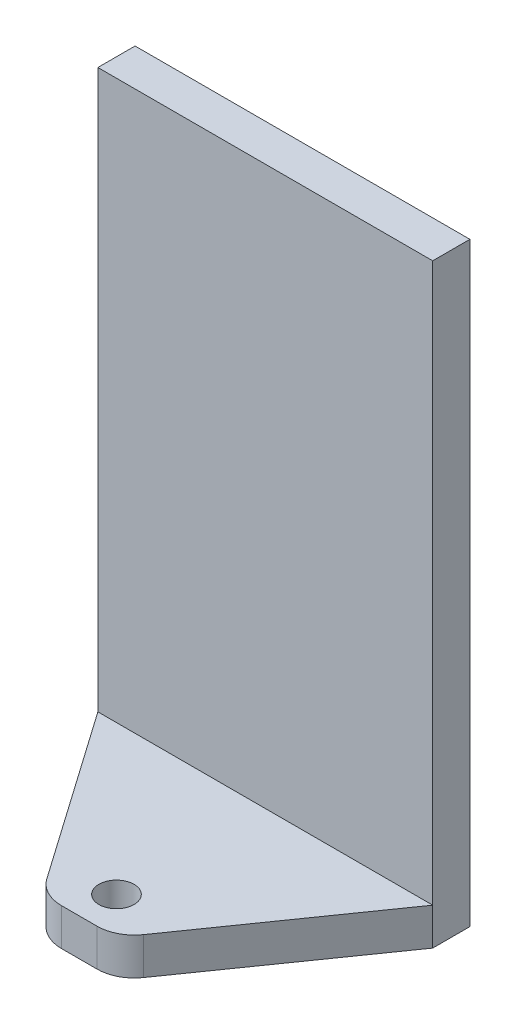
ISO-10303-21;
HEADER;
FILE_DESCRIPTION(('STEP AP214'),'2;1');
FILE_NAME('part.step','',(''),(''),'','','');
FILE_SCHEMA(('AUTOMOTIVE_DESIGN { 1 0 10303 214 1 1 1 1 }'));
ENDSEC;
DATA;
#1=APPLICATION_CONTEXT('core data for automotive mechanical design processes');
#2=APPLICATION_PROTOCOL_DEFINITION('international standard','automotive_design',2000,#1);
#3=PRODUCT_CONTEXT('',#1,'mechanical');
#4=PRODUCT('Part','Part','',(#3));
#5=PRODUCT_RELATED_PRODUCT_CATEGORY('part','',(#4));
#6=PRODUCT_DEFINITION_FORMATION('','',#4);
#7=PRODUCT_DEFINITION_CONTEXT('part definition',#1,'design');
#8=PRODUCT_DEFINITION('design','',#6,#7);
#9=PRODUCT_DEFINITION_SHAPE('','',#8);
#10=(LENGTH_UNIT() NAMED_UNIT(*) SI_UNIT(.MILLI.,.METRE.));
#11=(NAMED_UNIT(*) PLANE_ANGLE_UNIT() SI_UNIT($,.RADIAN.));
#12=(NAMED_UNIT(*) SI_UNIT($,.STERADIAN.) SOLID_ANGLE_UNIT());
#13=UNCERTAINTY_MEASURE_WITH_UNIT(LENGTH_MEASURE(1.E-05),#10,'distance_accuracy_value','');
#14=(GEOMETRIC_REPRESENTATION_CONTEXT(3) GLOBAL_UNCERTAINTY_ASSIGNED_CONTEXT((#13)) GLOBAL_UNIT_ASSIGNED_CONTEXT((#10,
#11,#12)) REPRESENTATION_CONTEXT('',''));
#15=CARTESIAN_POINT('',(0.,0.,0.));
#16=DIRECTION('',(0.,0.,1.));
#17=DIRECTION('',(1.,0.,0.));
#18=AXIS2_PLACEMENT_3D('',#15,#16,#17);
#19=CARTESIAN_POINT('',(28.575,-50.8,3.175));
#20=DIRECTION('',(-1.,0.,0.));
#21=DIRECTION('',(0.,0.,1.));
#22=AXIS2_PLACEMENT_3D('',#19,#20,#21);
#23=PLANE('',#22);
#24=DIRECTION('',(0.,1.,0.));
#25=VECTOR('',#24,1.);
#26=CARTESIAN_POINT('',(28.575,-50.8,3.175));
#27=LINE('',#26,#25);
#28=CARTESIAN_POINT('',(28.575,-44.45,3.175));
#29=VERTEX_POINT('',#28);
#30=CARTESIAN_POINT('',(28.575,50.8,3.175));
#31=VERTEX_POINT('',#30);
#32=EDGE_CURVE('E119',#29,#31,#27,.T.);
#33=ORIENTED_EDGE('',*,*,#32,.F.);
#34=DIRECTION('',(0.,1.,0.));
#35=VECTOR('',#34,1.);
#36=CARTESIAN_POINT('',(28.575,-50.8,3.175));
#37=LINE('',#36,#35);
#38=CARTESIAN_POINT('',(28.575,-50.8,3.175));
#39=VERTEX_POINT('',#38);
#40=EDGE_CURVE('E107',#39,#29,#37,.T.);
#41=ORIENTED_EDGE('',*,*,#40,.F.);
#42=DIRECTION('',(0.,0.,-1.));
#43=VECTOR('',#42,1.);
#44=CARTESIAN_POINT('',(28.575,-50.8,3.175));
#45=LINE('',#44,#43);
#46=CARTESIAN_POINT('',(28.575,-50.8,-3.175));
#47=VERTEX_POINT('',#46);
#48=EDGE_CURVE('E116',#39,#47,#45,.T.);
#49=ORIENTED_EDGE('',*,*,#48,.T.);
#50=DIRECTION('',(0.,1.,0.));
#51=VECTOR('',#50,1.);
#52=CARTESIAN_POINT('',(28.575,-50.8,-3.175));
#53=LINE('',#52,#51);
#54=CARTESIAN_POINT('',(28.575,50.8,-3.175));
#55=VERTEX_POINT('',#54);
#56=EDGE_CURVE('E185',#47,#55,#53,.T.);
#57=ORIENTED_EDGE('',*,*,#56,.T.);
#58=DIRECTION('',(0.,0.,-1.));
#59=VECTOR('',#58,1.);
#60=CARTESIAN_POINT('',(28.575,50.8,3.175));
#61=LINE('',#60,#59);
#62=EDGE_CURVE('E140',#31,#55,#61,.T.);
#63=ORIENTED_EDGE('',*,*,#62,.F.);
#64=EDGE_LOOP('',(#33,#41,#49,#57,#63));
#65=FACE_BOUND('',#64,.T.);
#66=ADVANCED_FACE('F34',(#65),#23,.F.);
#67=CARTESIAN_POINT('',(-28.575,50.8,3.175));
#68=DIRECTION('',(0.,-1.,0.));
#69=DIRECTION('',(0.,0.,-1.));
#70=AXIS2_PLACEMENT_3D('',#67,#68,#69);
#71=PLANE('',#70);
#72=DIRECTION('',(-1.,0.,0.));
#73=VECTOR('',#72,1.);
#74=CARTESIAN_POINT('',(-28.575,50.8,-3.175));
#75=LINE('',#74,#73);
#76=CARTESIAN_POINT('',(-28.575,50.8,-3.175));
#77=VERTEX_POINT('',#76);
#78=EDGE_CURVE('E189',#55,#77,#75,.T.);
#79=ORIENTED_EDGE('',*,*,#78,.T.);
#80=DIRECTION('',(0.,0.,-1.));
#81=VECTOR('',#80,1.);
#82=CARTESIAN_POINT('',(-28.575,50.8,3.175));
#83=LINE('',#82,#81);
#84=CARTESIAN_POINT('',(-28.575,50.8,3.175));
#85=VERTEX_POINT('',#84);
#86=EDGE_CURVE('E130',#85,#77,#83,.T.);
#87=ORIENTED_EDGE('',*,*,#86,.F.);
#88=DIRECTION('',(-1.,0.,0.));
#89=VECTOR('',#88,1.);
#90=CARTESIAN_POINT('',(-28.575,50.8,3.175));
#91=LINE('',#90,#89);
#92=EDGE_CURVE('E133',#31,#85,#91,.T.);
#93=ORIENTED_EDGE('',*,*,#92,.F.);
#94=ORIENTED_EDGE('',*,*,#62,.T.);
#95=EDGE_LOOP('',(#79,#87,#93,#94));
#96=FACE_BOUND('',#95,.T.);
#97=ADVANCED_FACE('F203',(#96),#71,.F.);
#98=CARTESIAN_POINT('',(-28.575,-50.8,3.175));
#99=DIRECTION('',(1.,0.,0.));
#100=DIRECTION('',(0.,0.,-1.));
#101=AXIS2_PLACEMENT_3D('',#98,#99,#100);
#102=PLANE('',#101);
#103=DIRECTION('',(0.,0.,-1.));
#104=VECTOR('',#103,1.);
#105=CARTESIAN_POINT('',(-28.575,-50.8,3.175));
#106=LINE('',#105,#104);
#107=CARTESIAN_POINT('',(-28.575,-50.8,3.175));
#108=VERTEX_POINT('',#107);
#109=CARTESIAN_POINT('',(-28.575,-50.8,-3.175));
#110=VERTEX_POINT('',#109);
#111=EDGE_CURVE('E127',#108,#110,#106,.T.);
#112=ORIENTED_EDGE('',*,*,#111,.F.);
#113=DIRECTION('',(0.,1.,0.));
#114=VECTOR('',#113,1.);
#115=CARTESIAN_POINT('',(-28.575,-50.8,3.175));
#116=LINE('',#115,#114);
#117=CARTESIAN_POINT('',(-28.575,-44.45,3.175));
#118=VERTEX_POINT('',#117);
#119=EDGE_CURVE('E120',#108,#118,#116,.T.);
#120=ORIENTED_EDGE('',*,*,#119,.T.);
#121=DIRECTION('',(0.,-1.,0.));
#122=VECTOR('',#121,1.);
#123=CARTESIAN_POINT('',(-28.575,-50.8,3.175));
#124=LINE('',#123,#122);
#125=EDGE_CURVE('E128',#85,#118,#124,.T.);
#126=ORIENTED_EDGE('',*,*,#125,.F.);
#127=ORIENTED_EDGE('',*,*,#86,.T.);
#128=DIRECTION('',(0.,-1.,0.));
#129=VECTOR('',#128,1.);
#130=CARTESIAN_POINT('',(-28.575,-50.8,-3.175));
#131=LINE('',#130,#129);
#132=EDGE_CURVE('E190',#77,#110,#131,.T.);
#133=ORIENTED_EDGE('',*,*,#132,.T.);
#134=EDGE_LOOP('',(#112,#120,#126,#127,#133));
#135=FACE_BOUND('',#134,.T.);
#136=ADVANCED_FACE('F195',(#135),#102,.F.);
#137=CARTESIAN_POINT('',(-28.575,-50.8,3.175));
#138=DIRECTION('',(0.,1.,0.));
#139=DIRECTION('',(0.,0.,1.));
#140=AXIS2_PLACEMENT_3D('',#137,#138,#139);
#141=PLANE('',#140);
#142=CARTESIAN_POINT('',(0.,-50.8,28.575));
#143=DIRECTION('',(0.,1.,0.));
#144=DIRECTION('',(0.,0.,1.));
#145=AXIS2_PLACEMENT_3D('',#142,#143,#144);
#146=CIRCLE('',#145,3.);
#147=CARTESIAN_POINT('',(0.,-50.8,31.575));
#148=VERTEX_POINT('',#147);
#149=EDGE_CURVE('E178',#148,#148,#146,.T.);
#150=ORIENTED_EDGE('',*,*,#149,.T.);
#151=EDGE_LOOP('',(#150));
#152=FACE_BOUND('',#151,.T.);
#153=DIRECTION('',(-0.573462344363328,0.,0.81923192051904));
#154=VECTOR('',#153,1.);
#155=CARTESIAN_POINT('',(6.35,-50.8,34.925));
#156=LINE('',#155,#154);
#157=CARTESIAN_POINT('',(8.24595987930501,-50.8,32.2164858867071));
#158=VERTEX_POINT('',#157);
#159=EDGE_CURVE('E104',#39,#158,#156,.T.);
#160=ORIENTED_EDGE('',*,*,#159,.T.);
#161=CARTESIAN_POINT('',(3.0438371840091,-50.8,28.575));
#162=DIRECTION('',(0.,1.,0.));
#163=DIRECTION('',(0.,0.,1.));
#164=AXIS2_PLACEMENT_3D('',#161,#162,#163);
#165=CIRCLE('',#164,6.35);
#166=CARTESIAN_POINT('',(3.0438371840091,-50.8,34.925));
#167=VERTEX_POINT('',#166);
#168=EDGE_CURVE('E42',#158,#167,#165,.F.);
#169=ORIENTED_EDGE('',*,*,#168,.T.);
#170=DIRECTION('',(-1.,0.,0.));
#171=VECTOR('',#170,1.);
#172=CARTESIAN_POINT('',(-6.35,-50.8,34.925));
#173=LINE('',#172,#171);
#174=CARTESIAN_POINT('',(-3.0438371840091,-50.8,34.925));
#175=VERTEX_POINT('',#174);
#176=EDGE_CURVE('E111',#167,#175,#173,.T.);
#177=ORIENTED_EDGE('',*,*,#176,.T.);
#178=CARTESIAN_POINT('',(-3.0438371840091,-50.8,28.575));
#179=DIRECTION('',(0.,1.,0.));
#180=DIRECTION('',(0.,0.,1.));
#181=AXIS2_PLACEMENT_3D('',#178,#179,#180);
#182=CIRCLE('',#181,6.35);
#183=CARTESIAN_POINT('',(-8.24595987930501,-50.8,32.2164858867071));
#184=VERTEX_POINT('',#183);
#185=EDGE_CURVE('E49',#175,#184,#182,.F.);
#186=ORIENTED_EDGE('',*,*,#185,.T.);
#187=DIRECTION('',(-0.573462344363328,0.,-0.81923192051904));
#188=VECTOR('',#187,1.);
#189=CARTESIAN_POINT('',(-28.575,-50.8,3.175));
#190=LINE('',#189,#188);
#191=EDGE_CURVE('E121',#184,#108,#190,.T.);
#192=ORIENTED_EDGE('',*,*,#191,.T.);
#193=ORIENTED_EDGE('',*,*,#111,.T.);
#194=DIRECTION('',(1.,0.,0.));
#195=VECTOR('',#194,1.);
#196=CARTESIAN_POINT('',(-28.575,-50.8,-3.175));
#197=LINE('',#196,#195);
#198=EDGE_CURVE('E125',#110,#47,#197,.T.);
#199=ORIENTED_EDGE('',*,*,#198,.T.);
#200=ORIENTED_EDGE('',*,*,#48,.F.);
#201=EDGE_LOOP('',(#160,#169,#177,#186,#192,#193,#199,#200));
#202=FACE_BOUND('',#201,.T.);
#203=ADVANCED_FACE('F123',(#152,#202),#141,.F.);
#204=CARTESIAN_POINT('',(0.,0.,3.175));
#205=DIRECTION('',(0.,0.,-1.));
#206=DIRECTION('',(-1.,0.,0.));
#207=AXIS2_PLACEMENT_3D('',#204,#205,#206);
#208=PLANE('',#207);
#209=ORIENTED_EDGE('',*,*,#125,.T.);
#210=DIRECTION('',(1.,0.,0.));
#211=VECTOR('',#210,1.);
#212=CARTESIAN_POINT('',(0.,-44.45,3.175));
#213=LINE('',#212,#211);
#214=EDGE_CURVE('E181',#118,#29,#213,.T.);
#215=ORIENTED_EDGE('',*,*,#214,.T.);
#216=ORIENTED_EDGE('',*,*,#32,.T.);
#217=ORIENTED_EDGE('',*,*,#92,.T.);
#218=EDGE_LOOP('',(#209,#215,#216,#217));
#219=FACE_BOUND('',#218,.T.);
#220=ADVANCED_FACE('F205',(#219),#208,.F.);
#221=CARTESIAN_POINT('',(0.,0.,-3.175));
#222=DIRECTION('',(0.,0.,-1.));
#223=DIRECTION('',(-1.,0.,0.));
#224=AXIS2_PLACEMENT_3D('',#221,#222,#223);
#225=PLANE('',#224);
#226=ORIENTED_EDGE('',*,*,#78,.F.);
#227=ORIENTED_EDGE('',*,*,#56,.F.);
#228=ORIENTED_EDGE('',*,*,#198,.F.);
#229=ORIENTED_EDGE('',*,*,#132,.F.);
#230=EDGE_LOOP('',(#226,#227,#228,#229));
#231=FACE_BOUND('',#230,.T.);
#232=ADVANCED_FACE('F200',(#231),#225,.T.);
#233=CARTESIAN_POINT('',(0.,-44.45,0.));
#234=DIRECTION('',(0.,1.,0.));
#235=DIRECTION('',(0.,0.,1.));
#236=AXIS2_PLACEMENT_3D('',#233,#234,#235);
#237=PLANE('',#236);
#238=DIRECTION('',(-1.,0.,0.));
#239=VECTOR('',#238,1.);
#240=CARTESIAN_POINT('',(-6.35,-44.45,34.925));
#241=LINE('',#240,#239);
#242=CARTESIAN_POINT('',(3.0438371840091,-44.45,34.925));
#243=VERTEX_POINT('',#242);
#244=CARTESIAN_POINT('',(-3.0438371840091,-44.45,34.925));
#245=VERTEX_POINT('',#244);
#246=EDGE_CURVE('E169',#243,#245,#241,.T.);
#247=ORIENTED_EDGE('',*,*,#246,.F.);
#248=CARTESIAN_POINT('',(3.0438371840091,-44.45,28.575));
#249=DIRECTION('',(0.,1.,0.));
#250=DIRECTION('',(0.,0.,1.));
#251=AXIS2_PLACEMENT_3D('',#248,#249,#250);
#252=CIRCLE('',#251,6.35);
#253=CARTESIAN_POINT('',(8.24595987930501,-44.45,32.2164858867071));
#254=VERTEX_POINT('',#253);
#255=EDGE_CURVE('E150',#243,#254,#252,.T.);
#256=ORIENTED_EDGE('',*,*,#255,.T.);
#257=DIRECTION('',(-0.573462344363328,0.,0.81923192051904));
#258=VECTOR('',#257,1.);
#259=CARTESIAN_POINT('',(6.35,-44.45,34.925));
#260=LINE('',#259,#258);
#261=EDGE_CURVE('E167',#29,#254,#260,.T.);
#262=ORIENTED_EDGE('',*,*,#261,.F.);
#263=ORIENTED_EDGE('',*,*,#214,.F.);
#264=DIRECTION('',(-0.573462344363328,0.,-0.81923192051904));
#265=VECTOR('',#264,1.);
#266=CARTESIAN_POINT('',(-28.575,-44.45,3.175));
#267=LINE('',#266,#265);
#268=CARTESIAN_POINT('',(-8.24595987930501,-44.45,32.2164858867071));
#269=VERTEX_POINT('',#268);
#270=EDGE_CURVE('E112',#269,#118,#267,.T.);
#271=ORIENTED_EDGE('',*,*,#270,.F.);
#272=CARTESIAN_POINT('',(-3.0438371840091,-44.45,28.575));
#273=DIRECTION('',(0.,1.,0.));
#274=DIRECTION('',(0.,0.,1.));
#275=AXIS2_PLACEMENT_3D('',#272,#273,#274);
#276=CIRCLE('',#275,6.35);
#277=EDGE_CURVE('E148',#269,#245,#276,.T.);
#278=ORIENTED_EDGE('',*,*,#277,.T.);
#279=EDGE_LOOP('',(#247,#256,#262,#263,#271,#278));
#280=FACE_BOUND('',#279,.T.);
#281=CARTESIAN_POINT('',(0.,-44.45,28.575));
#282=DIRECTION('',(0.,1.,0.));
#283=DIRECTION('',(0.,0.,1.));
#284=AXIS2_PLACEMENT_3D('',#281,#282,#283);
#285=CIRCLE('',#284,3.);
#286=CARTESIAN_POINT('',(0.,-44.45,31.575));
#287=VERTEX_POINT('',#286);
#288=EDGE_CURVE('E176',#287,#287,#285,.T.);
#289=ORIENTED_EDGE('',*,*,#288,.F.);
#290=EDGE_LOOP('',(#289));
#291=FACE_BOUND('',#290,.T.);
#292=ADVANCED_FACE('F164',(#280,#291),#237,.T.);
#293=CARTESIAN_POINT('',(0.,-50.8,28.575));
#294=DIRECTION('',(0.,1.,0.));
#295=DIRECTION('',(0.,0.,1.));
#296=AXIS2_PLACEMENT_3D('',#293,#294,#295);
#297=CYLINDRICAL_SURFACE('',#296,3.);
#298=ORIENTED_EDGE('',*,*,#149,.F.);
#299=EDGE_LOOP('',(#298));
#300=FACE_BOUND('',#299,.T.);
#301=ORIENTED_EDGE('',*,*,#288,.T.);
#302=EDGE_LOOP('',(#301));
#303=FACE_BOUND('',#302,.T.);
#304=ADVANCED_FACE('F234',(#300,#303),#297,.F.);
#305=CARTESIAN_POINT('',(-28.575,-50.8,3.175));
#306=DIRECTION('',(0.81923192051904,0.,-0.573462344363328));
#307=DIRECTION('',(-0.573462344363328,0.,-0.81923192051904));
#308=AXIS2_PLACEMENT_3D('',#305,#306,#307);
#309=PLANE('',#308);
#310=ORIENTED_EDGE('',*,*,#191,.F.);
#311=DIRECTION('',(0.,1.,0.));
#312=VECTOR('',#311,1.);
#313=CARTESIAN_POINT('',(-8.245959879305,-50.8,32.2164858867071));
#314=LINE('',#313,#312);
#315=EDGE_CURVE('E11',#184,#269,#314,.T.);
#316=ORIENTED_EDGE('',*,*,#315,.T.);
#317=ORIENTED_EDGE('',*,*,#270,.T.);
#318=ORIENTED_EDGE('',*,*,#119,.F.);
#319=EDGE_LOOP('',(#310,#316,#317,#318));
#320=FACE_BOUND('',#319,.T.);
#321=ADVANCED_FACE('F209',(#320),#309,.F.);
#322=CARTESIAN_POINT('',(-6.35,-50.8,34.925));
#323=DIRECTION('',(0.,0.,-1.));
#324=DIRECTION('',(-1.,0.,0.));
#325=AXIS2_PLACEMENT_3D('',#322,#323,#324);
#326=PLANE('',#325);
#327=ORIENTED_EDGE('',*,*,#176,.F.);
#328=DIRECTION('',(0.,1.,0.));
#329=VECTOR('',#328,1.);
#330=CARTESIAN_POINT('',(3.0438371840091,-50.8,34.925));
#331=LINE('',#330,#329);
#332=EDGE_CURVE('E145',#167,#243,#331,.T.);
#333=ORIENTED_EDGE('',*,*,#332,.T.);
#334=ORIENTED_EDGE('',*,*,#246,.T.);
#335=DIRECTION('',(0.,1.,0.));
#336=VECTOR('',#335,1.);
#337=CARTESIAN_POINT('',(-3.0438371840091,-50.8,34.925));
#338=LINE('',#337,#336);
#339=EDGE_CURVE('E143',#245,#175,#338,.F.);
#340=ORIENTED_EDGE('',*,*,#339,.T.);
#341=EDGE_LOOP('',(#327,#333,#334,#340));
#342=FACE_BOUND('',#341,.T.);
#343=ADVANCED_FACE('F157',(#342),#326,.F.);
#344=CARTESIAN_POINT('',(6.35,-50.8,34.925));
#345=DIRECTION('',(-0.81923192051904,0.,-0.573462344363328));
#346=DIRECTION('',(-0.573462344363328,0.,0.81923192051904));
#347=AXIS2_PLACEMENT_3D('',#344,#345,#346);
#348=PLANE('',#347);
#349=ORIENTED_EDGE('',*,*,#261,.T.);
#350=DIRECTION('',(0.,1.,0.));
#351=VECTOR('',#350,1.);
#352=CARTESIAN_POINT('',(8.24595987930501,-50.8,32.2164858867071));
#353=LINE('',#352,#351);
#354=EDGE_CURVE('E57',#254,#158,#353,.F.);
#355=ORIENTED_EDGE('',*,*,#354,.T.);
#356=ORIENTED_EDGE('',*,*,#159,.F.);
#357=ORIENTED_EDGE('',*,*,#40,.T.);
#358=EDGE_LOOP('',(#349,#355,#356,#357));
#359=FACE_BOUND('',#358,.T.);
#360=ADVANCED_FACE('F106',(#359),#348,.F.);
#361=CARTESIAN_POINT('',(3.0438371840091,-50.8,28.575));
#362=DIRECTION('',(0.,1.,0.));
#363=DIRECTION('',(0.,0.,1.));
#364=AXIS2_PLACEMENT_3D('',#361,#362,#363);
#365=CYLINDRICAL_SURFACE('',#364,6.35);
#366=ORIENTED_EDGE('',*,*,#168,.F.);
#367=ORIENTED_EDGE('',*,*,#354,.F.);
#368=ORIENTED_EDGE('',*,*,#255,.F.);
#369=ORIENTED_EDGE('',*,*,#332,.F.);
#370=EDGE_LOOP('',(#366,#367,#368,#369));
#371=FACE_BOUND('',#370,.T.);
#372=ADVANCED_FACE('F162',(#371),#365,.T.);
#373=CARTESIAN_POINT('',(-3.0438371840091,-50.8,28.575));
#374=DIRECTION('',(0.,1.,0.));
#375=DIRECTION('',(0.,0.,1.));
#376=AXIS2_PLACEMENT_3D('',#373,#374,#375);
#377=CYLINDRICAL_SURFACE('',#376,6.35);
#378=ORIENTED_EDGE('',*,*,#185,.F.);
#379=ORIENTED_EDGE('',*,*,#339,.F.);
#380=ORIENTED_EDGE('',*,*,#277,.F.);
#381=ORIENTED_EDGE('',*,*,#315,.F.);
#382=EDGE_LOOP('',(#378,#379,#380,#381));
#383=FACE_BOUND('',#382,.T.);
#384=ADVANCED_FACE('F36',(#383),#377,.T.);
#385=CLOSED_SHELL('',(#66,#97,#136,#203,#220,#232,#292,#304,#321,#343,#360,#372,#384));
#386=MANIFOLD_SOLID_BREP('B2',#385);
#387=ADVANCED_BREP_SHAPE_REPRESENTATION('',(#18,#386),#14);
#388=SHAPE_DEFINITION_REPRESENTATION(#9,#387);
ENDSEC;
END-ISO-10303-21;
